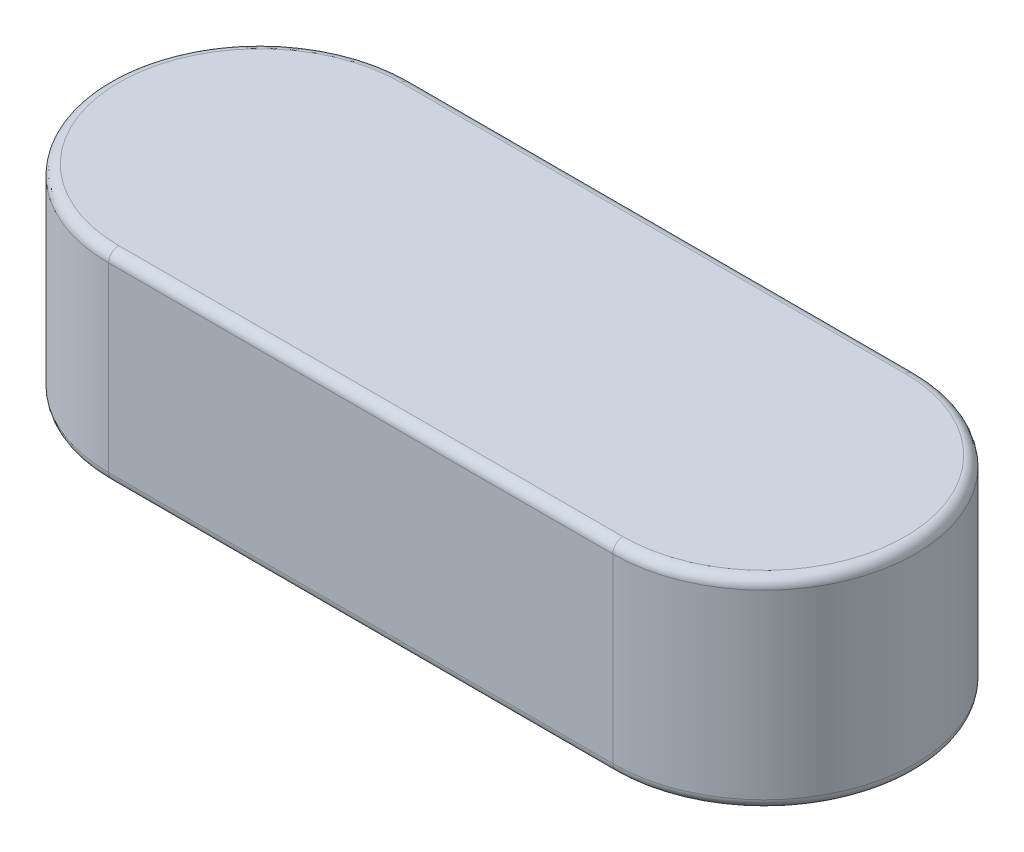
ISO-10303-21;
HEADER;
FILE_DESCRIPTION(('STEP AP214'),'2;1');
FILE_NAME('part.step','',(''),(''),'','','');
FILE_SCHEMA(('AUTOMOTIVE_DESIGN { 1 0 10303 214 1 1 1 1 }'));
ENDSEC;
DATA;
#1=APPLICATION_CONTEXT('core data for automotive mechanical design processes');
#2=APPLICATION_PROTOCOL_DEFINITION('international standard','automotive_design',2000,#1);
#3=PRODUCT_CONTEXT('',#1,'mechanical');
#4=PRODUCT('Part','Part','',(#3));
#5=PRODUCT_RELATED_PRODUCT_CATEGORY('part','',(#4));
#6=PRODUCT_DEFINITION_FORMATION('','',#4);
#7=PRODUCT_DEFINITION_CONTEXT('part definition',#1,'design');
#8=PRODUCT_DEFINITION('design','',#6,#7);
#9=PRODUCT_DEFINITION_SHAPE('','',#8);
#10=(LENGTH_UNIT() NAMED_UNIT(*) SI_UNIT(.MILLI.,.METRE.));
#11=(NAMED_UNIT(*) PLANE_ANGLE_UNIT() SI_UNIT($,.RADIAN.));
#12=(NAMED_UNIT(*) SI_UNIT($,.STERADIAN.) SOLID_ANGLE_UNIT());
#13=UNCERTAINTY_MEASURE_WITH_UNIT(LENGTH_MEASURE(1.E-05),#10,'distance_accuracy_value','');
#14=(GEOMETRIC_REPRESENTATION_CONTEXT(3) GLOBAL_UNCERTAINTY_ASSIGNED_CONTEXT((#13)) GLOBAL_UNIT_ASSIGNED_CONTEXT((#10,
#11,#12)) REPRESENTATION_CONTEXT('',''));
#15=CARTESIAN_POINT('',(0.,0.,0.));
#16=DIRECTION('',(0.,0.,1.));
#17=DIRECTION('',(1.,0.,0.));
#18=AXIS2_PLACEMENT_3D('',#15,#16,#17);
#19=CARTESIAN_POINT('',(-20.,8.,0.));
#20=DIRECTION('',(0.,-1.,0.));
#21=DIRECTION('',(0.,0.,-1.));
#22=AXIS2_PLACEMENT_3D('',#19,#20,#21);
#23=CYLINDRICAL_SURFACE('',#22,6.);
#24=DIRECTION('',(0.,-1.,0.));
#25=VECTOR('',#24,1.);
#26=CARTESIAN_POINT('',(-20.,8.,-6.));
#27=LINE('',#26,#25);
#28=CARTESIAN_POINT('',(-20.,7.6,-6.));
#29=VERTEX_POINT('',#28);
#30=CARTESIAN_POINT('',(-20.,0.4,-6.));
#31=VERTEX_POINT('',#30);
#32=EDGE_CURVE('E108',#29,#31,#27,.T.);
#33=ORIENTED_EDGE('',*,*,#32,.T.);
#34=CARTESIAN_POINT('',(-20.,0.4,0.));
#35=DIRECTION('',(0.,1.,0.));
#36=DIRECTION('',(0.,0.,1.));
#37=AXIS2_PLACEMENT_3D('',#34,#35,#36);
#38=CIRCLE('',#37,6.);
#39=CARTESIAN_POINT('',(-20.,0.4,6.));
#40=VERTEX_POINT('',#39);
#41=EDGE_CURVE('E115',#31,#40,#38,.T.);
#42=ORIENTED_EDGE('',*,*,#41,.T.);
#43=DIRECTION('',(0.,-1.,0.));
#44=VECTOR('',#43,1.);
#45=CARTESIAN_POINT('',(-20.,8.,6.));
#46=LINE('',#45,#44);
#47=CARTESIAN_POINT('',(-20.,7.6,6.));
#48=VERTEX_POINT('',#47);
#49=EDGE_CURVE('E110',#48,#40,#46,.T.);
#50=ORIENTED_EDGE('',*,*,#49,.F.);
#51=CARTESIAN_POINT('',(-20.,7.6,0.));
#52=DIRECTION('',(0.,1.,0.));
#53=DIRECTION('',(0.,0.,1.));
#54=AXIS2_PLACEMENT_3D('',#51,#52,#53);
#55=CIRCLE('',#54,6.);
#56=EDGE_CURVE('E106',#48,#29,#55,.F.);
#57=ORIENTED_EDGE('',*,*,#56,.T.);
#58=EDGE_LOOP('',(#33,#42,#50,#57));
#59=FACE_BOUND('',#58,.T.);
#60=ADVANCED_FACE('F37',(#59),#23,.T.);
#61=CARTESIAN_POINT('',(-20.,8.,6.));
#62=DIRECTION('',(0.,0.,-1.));
#63=DIRECTION('',(-1.,0.,0.));
#64=AXIS2_PLACEMENT_3D('',#61,#62,#63);
#65=PLANE('',#64);
#66=ORIENTED_EDGE('',*,*,#49,.T.);
#67=DIRECTION('',(1.,0.,0.));
#68=VECTOR('',#67,1.);
#69=CARTESIAN_POINT('',(-20.,0.4,6.));
#70=LINE('',#69,#68);
#71=CARTESIAN_POINT('',(0.,0.4,6.));
#72=VERTEX_POINT('',#71);
#73=EDGE_CURVE('E159',#40,#72,#70,.T.);
#74=ORIENTED_EDGE('',*,*,#73,.T.);
#75=DIRECTION('',(0.,-1.,0.));
#76=VECTOR('',#75,1.);
#77=CARTESIAN_POINT('',(0.,8.,6.));
#78=LINE('',#77,#76);
#79=CARTESIAN_POINT('',(0.,7.6,6.));
#80=VERTEX_POINT('',#79);
#81=EDGE_CURVE('E140',#80,#72,#78,.T.);
#82=ORIENTED_EDGE('',*,*,#81,.F.);
#83=DIRECTION('',(1.,0.,0.));
#84=VECTOR('',#83,1.);
#85=CARTESIAN_POINT('',(-20.,7.6,6.));
#86=LINE('',#85,#84);
#87=EDGE_CURVE('E157',#80,#48,#86,.F.);
#88=ORIENTED_EDGE('',*,*,#87,.T.);
#89=EDGE_LOOP('',(#66,#74,#82,#88));
#90=FACE_BOUND('',#89,.T.);
#91=ADVANCED_FACE('F185',(#90),#65,.F.);
#92=CARTESIAN_POINT('',(0.,8.,0.));
#93=DIRECTION('',(0.,-1.,0.));
#94=DIRECTION('',(0.,0.,-1.));
#95=AXIS2_PLACEMENT_3D('',#92,#93,#94);
#96=CYLINDRICAL_SURFACE('',#95,6.);
#97=ORIENTED_EDGE('',*,*,#81,.T.);
#98=CARTESIAN_POINT('',(0.,0.4,0.));
#99=DIRECTION('',(0.,1.,0.));
#100=DIRECTION('',(0.,0.,1.));
#101=AXIS2_PLACEMENT_3D('',#98,#99,#100);
#102=CIRCLE('',#101,6.);
#103=CARTESIAN_POINT('',(0.,0.4,-6.));
#104=VERTEX_POINT('',#103);
#105=EDGE_CURVE('E116',#72,#104,#102,.T.);
#106=ORIENTED_EDGE('',*,*,#105,.T.);
#107=DIRECTION('',(0.,-1.,0.));
#108=VECTOR('',#107,1.);
#109=CARTESIAN_POINT('',(0.,8.,-6.));
#110=LINE('',#109,#108);
#111=CARTESIAN_POINT('',(0.,7.6,-6.));
#112=VERTEX_POINT('',#111);
#113=EDGE_CURVE('E127',#112,#104,#110,.T.);
#114=ORIENTED_EDGE('',*,*,#113,.F.);
#115=CARTESIAN_POINT('',(0.,7.6,0.));
#116=DIRECTION('',(0.,1.,0.));
#117=DIRECTION('',(0.,0.,1.));
#118=AXIS2_PLACEMENT_3D('',#115,#116,#117);
#119=CIRCLE('',#118,6.);
#120=EDGE_CURVE('E152',#112,#80,#119,.F.);
#121=ORIENTED_EDGE('',*,*,#120,.T.);
#122=EDGE_LOOP('',(#97,#106,#114,#121));
#123=FACE_BOUND('',#122,.T.);
#124=ADVANCED_FACE('F183',(#123),#96,.T.);
#125=CARTESIAN_POINT('',(-20.,8.,-6.));
#126=DIRECTION('',(0.,0.,1.));
#127=DIRECTION('',(1.,0.,0.));
#128=AXIS2_PLACEMENT_3D('',#125,#126,#127);
#129=PLANE('',#128);
#130=ORIENTED_EDGE('',*,*,#113,.T.);
#131=DIRECTION('',(-1.,0.,0.));
#132=VECTOR('',#131,1.);
#133=CARTESIAN_POINT('',(-20.,0.4,-6.));
#134=LINE('',#133,#132);
#135=EDGE_CURVE('E126',#104,#31,#134,.T.);
#136=ORIENTED_EDGE('',*,*,#135,.T.);
#137=ORIENTED_EDGE('',*,*,#32,.F.);
#138=DIRECTION('',(-1.,0.,0.));
#139=VECTOR('',#138,1.);
#140=CARTESIAN_POINT('',(0.,7.6,-6.));
#141=LINE('',#140,#139);
#142=EDGE_CURVE('E123',#29,#112,#141,.F.);
#143=ORIENTED_EDGE('',*,*,#142,.T.);
#144=EDGE_LOOP('',(#130,#136,#137,#143));
#145=FACE_BOUND('',#144,.T.);
#146=ADVANCED_FACE('F121',(#145),#129,.F.);
#147=CARTESIAN_POINT('',(-20.,8.,0.));
#148=DIRECTION('',(0.,1.,0.));
#149=DIRECTION('',(0.,0.,1.));
#150=AXIS2_PLACEMENT_3D('',#147,#148,#149);
#151=PLANE('',#150);
#152=DIRECTION('',(1.,0.,0.));
#153=VECTOR('',#152,1.);
#154=CARTESIAN_POINT('',(0.,8.,5.6));
#155=LINE('',#154,#153);
#156=CARTESIAN_POINT('',(-20.,8.,5.6));
#157=VERTEX_POINT('',#156);
#158=CARTESIAN_POINT('',(0.,8.,5.6));
#159=VERTEX_POINT('',#158);
#160=EDGE_CURVE('E46',#157,#159,#155,.T.);
#161=ORIENTED_EDGE('',*,*,#160,.T.);
#162=CARTESIAN_POINT('',(0.,8.,0.));
#163=DIRECTION('',(0.,1.,0.));
#164=DIRECTION('',(0.,0.,1.));
#165=AXIS2_PLACEMENT_3D('',#162,#163,#164);
#166=CIRCLE('',#165,5.6);
#167=CARTESIAN_POINT('',(0.,8.,-5.6));
#168=VERTEX_POINT('',#167);
#169=EDGE_CURVE('E11',#159,#168,#166,.T.);
#170=ORIENTED_EDGE('',*,*,#169,.T.);
#171=DIRECTION('',(-1.,0.,0.));
#172=VECTOR('',#171,1.);
#173=CARTESIAN_POINT('',(-20.,8.,-5.6));
#174=LINE('',#173,#172);
#175=CARTESIAN_POINT('',(-20.,8.,-5.6));
#176=VERTEX_POINT('',#175);
#177=EDGE_CURVE('E162',#168,#176,#174,.T.);
#178=ORIENTED_EDGE('',*,*,#177,.T.);
#179=CARTESIAN_POINT('',(-20.,8.,0.));
#180=DIRECTION('',(0.,1.,0.));
#181=DIRECTION('',(0.,0.,1.));
#182=AXIS2_PLACEMENT_3D('',#179,#180,#181);
#183=CIRCLE('',#182,5.6);
#184=EDGE_CURVE('E133',#176,#157,#183,.T.);
#185=ORIENTED_EDGE('',*,*,#184,.T.);
#186=EDGE_LOOP('',(#161,#170,#178,#185));
#187=FACE_BOUND('',#186,.T.);
#188=ADVANCED_FACE('F208',(#187),#151,.T.);
#189=CARTESIAN_POINT('',(-20.,0.,0.));
#190=DIRECTION('',(0.,1.,0.));
#191=DIRECTION('',(0.,0.,1.));
#192=AXIS2_PLACEMENT_3D('',#189,#190,#191);
#193=PLANE('',#192);
#194=CARTESIAN_POINT('',(-20.,0.,0.));
#195=DIRECTION('',(0.,1.,0.));
#196=DIRECTION('',(0.,0.,1.));
#197=AXIS2_PLACEMENT_3D('',#194,#195,#196);
#198=CIRCLE('',#197,5.6);
#199=CARTESIAN_POINT('',(-20.,0.,5.6));
#200=VERTEX_POINT('',#199);
#201=CARTESIAN_POINT('',(-20.,0.,-5.6));
#202=VERTEX_POINT('',#201);
#203=EDGE_CURVE('E145',#200,#202,#198,.F.);
#204=ORIENTED_EDGE('',*,*,#203,.T.);
#205=DIRECTION('',(-1.,0.,0.));
#206=VECTOR('',#205,1.);
#207=CARTESIAN_POINT('',(-20.,0.,-5.6));
#208=LINE('',#207,#206);
#209=CARTESIAN_POINT('',(0.,0.,-5.6));
#210=VERTEX_POINT('',#209);
#211=EDGE_CURVE('E149',#202,#210,#208,.F.);
#212=ORIENTED_EDGE('',*,*,#211,.T.);
#213=CARTESIAN_POINT('',(0.,0.,0.));
#214=DIRECTION('',(0.,1.,0.));
#215=DIRECTION('',(0.,0.,1.));
#216=AXIS2_PLACEMENT_3D('',#213,#214,#215);
#217=CIRCLE('',#216,5.6);
#218=CARTESIAN_POINT('',(0.,0.,5.6));
#219=VERTEX_POINT('',#218);
#220=EDGE_CURVE('E147',#210,#219,#217,.F.);
#221=ORIENTED_EDGE('',*,*,#220,.T.);
#222=DIRECTION('',(1.,0.,0.));
#223=VECTOR('',#222,1.);
#224=CARTESIAN_POINT('',(-20.,0.,5.6));
#225=LINE('',#224,#223);
#226=EDGE_CURVE('E138',#219,#200,#225,.F.);
#227=ORIENTED_EDGE('',*,*,#226,.T.);
#228=EDGE_LOOP('',(#204,#212,#221,#227));
#229=FACE_BOUND('',#228,.T.);
#230=ADVANCED_FACE('F206',(#229),#193,.F.);
#231=CARTESIAN_POINT('',(-20.,0.4,5.6));
#232=DIRECTION('',(1.,0.,0.));
#233=DIRECTION('',(0.,0.,-1.));
#234=AXIS2_PLACEMENT_3D('',#231,#232,#233);
#235=CYLINDRICAL_SURFACE('',#234,0.4);
#236=CARTESIAN_POINT('',(-20.,0.4,5.6));
#237=DIRECTION('',(-1.,0.,0.));
#238=DIRECTION('',(0.,0.,1.));
#239=AXIS2_PLACEMENT_3D('',#236,#237,#238);
#240=CIRCLE('',#239,0.4);
#241=EDGE_CURVE('E169',#200,#40,#240,.T.);
#242=ORIENTED_EDGE('',*,*,#241,.F.);
#243=ORIENTED_EDGE('',*,*,#226,.F.);
#244=CARTESIAN_POINT('',(0.,0.4,5.6));
#245=DIRECTION('',(1.,0.,0.));
#246=DIRECTION('',(0.,0.,-1.));
#247=AXIS2_PLACEMENT_3D('',#244,#245,#246);
#248=CIRCLE('',#247,0.4);
#249=EDGE_CURVE('E128',#72,#219,#248,.T.);
#250=ORIENTED_EDGE('',*,*,#249,.F.);
#251=ORIENTED_EDGE('',*,*,#73,.F.);
#252=EDGE_LOOP('',(#242,#243,#250,#251));
#253=FACE_BOUND('',#252,.T.);
#254=ADVANCED_FACE('F203',(#253),#235,.T.);
#255=CARTESIAN_POINT('',(0.,0.4,0.));
#256=DIRECTION('',(0.,1.,0.));
#257=DIRECTION('',(0.,0.,1.));
#258=AXIS2_PLACEMENT_3D('',#255,#256,#257);
#259=TOROIDAL_SURFACE('',#258,5.6,0.4);
#260=ORIENTED_EDGE('',*,*,#249,.T.);
#261=ORIENTED_EDGE('',*,*,#220,.F.);
#262=CARTESIAN_POINT('',(0.,0.4,-5.6));
#263=DIRECTION('',(-1.,0.,0.));
#264=DIRECTION('',(0.,-1.,0.));
#265=AXIS2_PLACEMENT_3D('',#262,#263,#264);
#266=CIRCLE('',#265,0.4);
#267=EDGE_CURVE('E167',#104,#210,#266,.T.);
#268=ORIENTED_EDGE('',*,*,#267,.F.);
#269=ORIENTED_EDGE('',*,*,#105,.F.);
#270=EDGE_LOOP('',(#260,#261,#268,#269));
#271=FACE_BOUND('',#270,.T.);
#272=ADVANCED_FACE('F192',(#271),#259,.T.);
#273=CARTESIAN_POINT('',(-20.,0.4,0.));
#274=DIRECTION('',(0.,1.,0.));
#275=DIRECTION('',(0.,0.,1.));
#276=AXIS2_PLACEMENT_3D('',#273,#274,#275);
#277=TOROIDAL_SURFACE('',#276,5.6,0.4);
#278=ORIENTED_EDGE('',*,*,#241,.T.);
#279=ORIENTED_EDGE('',*,*,#41,.F.);
#280=CARTESIAN_POINT('',(-20.,0.4,-5.6));
#281=DIRECTION('',(1.,0.,0.));
#282=DIRECTION('',(0.,0.,-1.));
#283=AXIS2_PLACEMENT_3D('',#280,#281,#282);
#284=CIRCLE('',#283,0.4);
#285=EDGE_CURVE('E165',#202,#31,#284,.T.);
#286=ORIENTED_EDGE('',*,*,#285,.F.);
#287=ORIENTED_EDGE('',*,*,#203,.F.);
#288=EDGE_LOOP('',(#278,#279,#286,#287));
#289=FACE_BOUND('',#288,.T.);
#290=ADVANCED_FACE('F200',(#289),#277,.T.);
#291=CARTESIAN_POINT('',(-20.,0.4,-5.6));
#292=DIRECTION('',(-1.,0.,0.));
#293=DIRECTION('',(0.,0.,1.));
#294=AXIS2_PLACEMENT_3D('',#291,#292,#293);
#295=CYLINDRICAL_SURFACE('',#294,0.4);
#296=ORIENTED_EDGE('',*,*,#267,.T.);
#297=ORIENTED_EDGE('',*,*,#211,.F.);
#298=ORIENTED_EDGE('',*,*,#285,.T.);
#299=ORIENTED_EDGE('',*,*,#135,.F.);
#300=EDGE_LOOP('',(#296,#297,#298,#299));
#301=FACE_BOUND('',#300,.T.);
#302=ADVANCED_FACE('F195',(#301),#295,.T.);
#303=CARTESIAN_POINT('',(-20.,7.6,0.));
#304=DIRECTION('',(0.,1.,0.));
#305=DIRECTION('',(0.,0.,1.));
#306=AXIS2_PLACEMENT_3D('',#303,#304,#305);
#307=TOROIDAL_SURFACE('',#306,5.6,0.4);
#308=CARTESIAN_POINT('',(-20.,7.6,-5.6));
#309=DIRECTION('',(1.,0.,0.));
#310=DIRECTION('',(0.,0.,-1.));
#311=AXIS2_PLACEMENT_3D('',#308,#309,#310);
#312=CIRCLE('',#311,0.4);
#313=EDGE_CURVE('E132',#29,#176,#312,.T.);
#314=ORIENTED_EDGE('',*,*,#313,.F.);
#315=ORIENTED_EDGE('',*,*,#56,.F.);
#316=CARTESIAN_POINT('',(-20.,7.6,5.6));
#317=DIRECTION('',(1.,0.,0.));
#318=DIRECTION('',(0.,0.,-1.));
#319=AXIS2_PLACEMENT_3D('',#316,#317,#318);
#320=CIRCLE('',#319,0.4);
#321=EDGE_CURVE('E41',#157,#48,#320,.T.);
#322=ORIENTED_EDGE('',*,*,#321,.F.);
#323=ORIENTED_EDGE('',*,*,#184,.F.);
#324=EDGE_LOOP('',(#314,#315,#322,#323));
#325=FACE_BOUND('',#324,.T.);
#326=ADVANCED_FACE('F39',(#325),#307,.T.);
#327=CARTESIAN_POINT('',(-20.,7.6,5.6));
#328=DIRECTION('',(-1.,0.,0.));
#329=DIRECTION('',(0.,0.,1.));
#330=AXIS2_PLACEMENT_3D('',#327,#328,#329);
#331=CYLINDRICAL_SURFACE('',#330,0.4);
#332=ORIENTED_EDGE('',*,*,#321,.T.);
#333=ORIENTED_EDGE('',*,*,#87,.F.);
#334=CARTESIAN_POINT('',(0.,7.6,5.6));
#335=DIRECTION('',(1.,0.,0.));
#336=DIRECTION('',(0.,0.,-1.));
#337=AXIS2_PLACEMENT_3D('',#334,#335,#336);
#338=CIRCLE('',#337,0.4);
#339=EDGE_CURVE('E135',#159,#80,#338,.T.);
#340=ORIENTED_EDGE('',*,*,#339,.F.);
#341=ORIENTED_EDGE('',*,*,#160,.F.);
#342=EDGE_LOOP('',(#332,#333,#340,#341));
#343=FACE_BOUND('',#342,.T.);
#344=ADVANCED_FACE('F178',(#343),#331,.T.);
#345=CARTESIAN_POINT('',(-20.,7.6,-5.6));
#346=DIRECTION('',(1.,0.,0.));
#347=DIRECTION('',(0.,0.,-1.));
#348=AXIS2_PLACEMENT_3D('',#345,#346,#347);
#349=CYLINDRICAL_SURFACE('',#348,0.4);
#350=ORIENTED_EDGE('',*,*,#313,.T.);
#351=ORIENTED_EDGE('',*,*,#177,.F.);
#352=CARTESIAN_POINT('',(0.,7.6,-5.6));
#353=DIRECTION('',(1.,0.,0.));
#354=DIRECTION('',(0.,0.,-1.));
#355=AXIS2_PLACEMENT_3D('',#352,#353,#354);
#356=CIRCLE('',#355,0.4);
#357=EDGE_CURVE('E60',#112,#168,#356,.T.);
#358=ORIENTED_EDGE('',*,*,#357,.F.);
#359=ORIENTED_EDGE('',*,*,#142,.F.);
#360=EDGE_LOOP('',(#350,#351,#358,#359));
#361=FACE_BOUND('',#360,.T.);
#362=ADVANCED_FACE('F136',(#361),#349,.T.);
#363=CARTESIAN_POINT('',(0.,7.6,0.));
#364=DIRECTION('',(0.,1.,0.));
#365=DIRECTION('',(0.,0.,1.));
#366=AXIS2_PLACEMENT_3D('',#363,#364,#365);
#367=TOROIDAL_SURFACE('',#366,5.6,0.4);
#368=ORIENTED_EDGE('',*,*,#339,.T.);
#369=ORIENTED_EDGE('',*,*,#120,.F.);
#370=ORIENTED_EDGE('',*,*,#357,.T.);
#371=ORIENTED_EDGE('',*,*,#169,.F.);
#372=EDGE_LOOP('',(#368,#369,#370,#371));
#373=FACE_BOUND('',#372,.T.);
#374=ADVANCED_FACE('F176',(#373),#367,.T.);
#375=CLOSED_SHELL('',(#60,#91,#124,#146,#188,#230,#254,#272,#290,#302,#326,#344,#362,#374));
#376=MANIFOLD_SOLID_BREP('B2',#375);
#377=ADVANCED_BREP_SHAPE_REPRESENTATION('',(#18,#376),#14);
#378=SHAPE_DEFINITION_REPRESENTATION(#9,#377);
ENDSEC;
END-ISO-10303-21;
